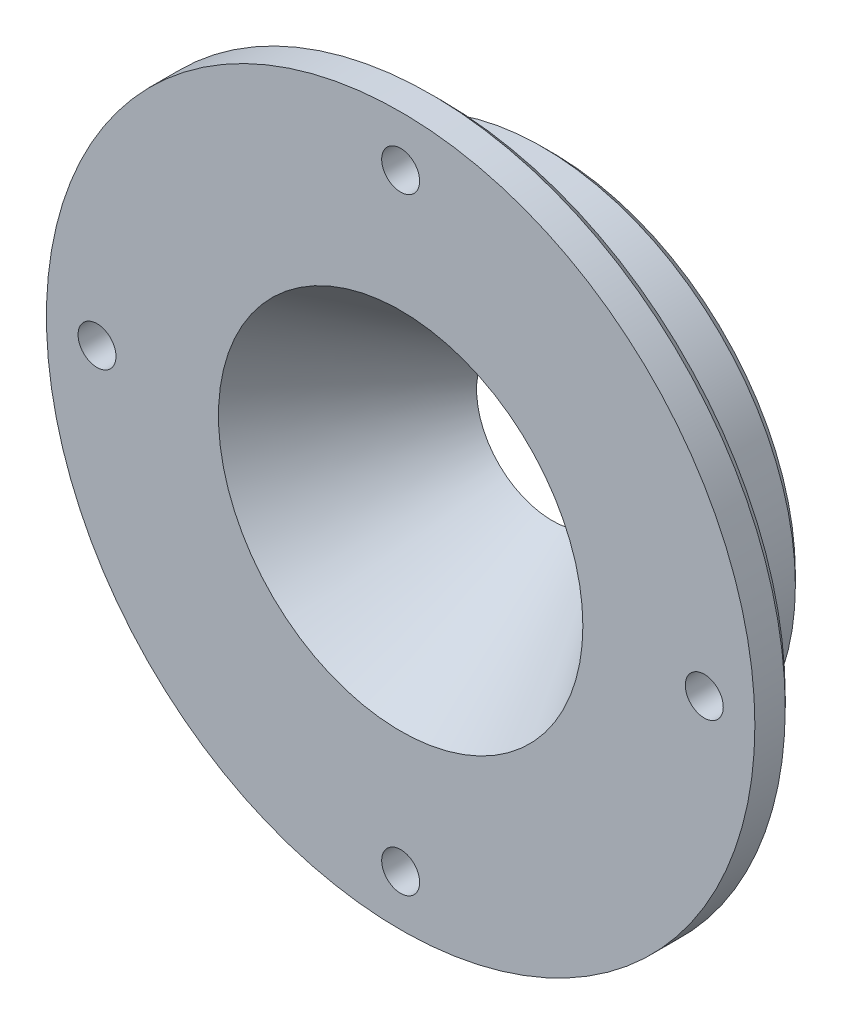
ISO-10303-21;
HEADER;
FILE_DESCRIPTION(('STEP AP214'),'2;1');
FILE_NAME('part.step','',(''),(''),'','','');
FILE_SCHEMA(('AUTOMOTIVE_DESIGN { 1 0 10303 214 1 1 1 1 }'));
ENDSEC;
DATA;
#1=APPLICATION_CONTEXT('core data for automotive mechanical design processes');
#2=APPLICATION_PROTOCOL_DEFINITION('international standard','automotive_design',2000,#1);
#3=PRODUCT_CONTEXT('',#1,'mechanical');
#4=PRODUCT('Part','Part','',(#3));
#5=PRODUCT_RELATED_PRODUCT_CATEGORY('part','',(#4));
#6=PRODUCT_DEFINITION_FORMATION('','',#4);
#7=PRODUCT_DEFINITION_CONTEXT('part definition',#1,'design');
#8=PRODUCT_DEFINITION('design','',#6,#7);
#9=PRODUCT_DEFINITION_SHAPE('','',#8);
#10=(LENGTH_UNIT() NAMED_UNIT(*) SI_UNIT(.MILLI.,.METRE.));
#11=(NAMED_UNIT(*) PLANE_ANGLE_UNIT() SI_UNIT($,.RADIAN.));
#12=(NAMED_UNIT(*) SI_UNIT($,.STERADIAN.) SOLID_ANGLE_UNIT());
#13=UNCERTAINTY_MEASURE_WITH_UNIT(LENGTH_MEASURE(1.E-05),#10,'distance_accuracy_value','');
#14=(GEOMETRIC_REPRESENTATION_CONTEXT(3) GLOBAL_UNCERTAINTY_ASSIGNED_CONTEXT((#13)) GLOBAL_UNIT_ASSIGNED_CONTEXT((#10,
#11,#12)) REPRESENTATION_CONTEXT('',''));
#15=CARTESIAN_POINT('',(0.,0.,0.));
#16=DIRECTION('',(0.,0.,1.));
#17=DIRECTION('',(1.,0.,0.));
#18=AXIS2_PLACEMENT_3D('',#15,#16,#17);
#19=CARTESIAN_POINT('',(0.,44.45,0.));
#20=DIRECTION('',(0.,0.,-1.));
#21=DIRECTION('',(-1.,0.,0.));
#22=AXIS2_PLACEMENT_3D('',#19,#20,#21);
#23=PLANE('',#22);
#24=CARTESIAN_POINT('',(0.,38.1,0.));
#25=DIRECTION('',(0.,0.,1.));
#26=DIRECTION('',(1.,0.,0.));
#27=AXIS2_PLACEMENT_3D('',#24,#25,#26);
#28=CIRCLE('',#27,2.38124999999999);
#29=CARTESIAN_POINT('',(2.38124999999999,38.1,0.));
#30=VERTEX_POINT('',#29);
#31=EDGE_CURVE('E93',#30,#30,#28,.T.);
#32=ORIENTED_EDGE('',*,*,#31,.F.);
#33=EDGE_LOOP('',(#32));
#34=FACE_BOUND('',#33,.T.);
#35=CARTESIAN_POINT('',(38.1000000000011,1.07820122499364E-12,0.));
#36=DIRECTION('',(0.,0.,1.));
#37=DIRECTION('',(1.,0.,0.));
#38=AXIS2_PLACEMENT_3D('',#35,#36,#37);
#39=CIRCLE('',#38,2.38124999999999);
#40=CARTESIAN_POINT('',(40.4812500000011,1.07820122499364E-12,0.));
#41=VERTEX_POINT('',#40);
#42=EDGE_CURVE('E87',#41,#41,#39,.T.);
#43=ORIENTED_EDGE('',*,*,#42,.F.);
#44=EDGE_LOOP('',(#43));
#45=FACE_BOUND('',#44,.T.);
#46=CARTESIAN_POINT('',(2.15640244998728E-12,-38.1,0.));
#47=DIRECTION('',(0.,0.,1.));
#48=DIRECTION('',(1.,0.,0.));
#49=AXIS2_PLACEMENT_3D('',#46,#47,#48);
#50=CIRCLE('',#49,2.38124999999999);
#51=CARTESIAN_POINT('',(2.38125000000214,-38.1,0.));
#52=VERTEX_POINT('',#51);
#53=EDGE_CURVE('E81',#52,#52,#50,.T.);
#54=ORIENTED_EDGE('',*,*,#53,.F.);
#55=EDGE_LOOP('',(#54));
#56=FACE_BOUND('',#55,.T.);
#57=CARTESIAN_POINT('',(-38.0999999999989,-1.07353532068889E-12,0.));
#58=DIRECTION('',(0.,0.,1.));
#59=DIRECTION('',(1.,0.,0.));
#60=AXIS2_PLACEMENT_3D('',#57,#58,#59);
#61=CIRCLE('',#60,2.38124999999999);
#62=CARTESIAN_POINT('',(-35.7187499999989,-1.07353532068889E-12,0.));
#63=VERTEX_POINT('',#62);
#64=EDGE_CURVE('E75',#63,#63,#61,.T.);
#65=ORIENTED_EDGE('',*,*,#64,.F.);
#66=EDGE_LOOP('',(#65));
#67=FACE_BOUND('',#66,.T.);
#68=CARTESIAN_POINT('',(0.,0.,0.));
#69=DIRECTION('',(0.,0.,1.));
#70=DIRECTION('',(1.,0.,0.));
#71=AXIS2_PLACEMENT_3D('',#68,#69,#70);
#72=CIRCLE('',#71,22.863953602895);
#73=CARTESIAN_POINT('',(22.863953602895,0.,0.));
#74=VERTEX_POINT('',#73);
#75=EDGE_CURVE('E69',#74,#74,#72,.T.);
#76=ORIENTED_EDGE('',*,*,#75,.F.);
#77=EDGE_LOOP('',(#76));
#78=FACE_BOUND('',#77,.T.);
#79=CARTESIAN_POINT('',(0.,0.,0.));
#80=DIRECTION('',(0.,0.,1.));
#81=DIRECTION('',(1.,0.,0.));
#82=AXIS2_PLACEMENT_3D('',#79,#80,#81);
#83=CIRCLE('',#82,44.45);
#84=CARTESIAN_POINT('',(44.45,0.,0.));
#85=VERTEX_POINT('',#84);
#86=EDGE_CURVE('E63',#85,#85,#83,.T.);
#87=ORIENTED_EDGE('',*,*,#86,.T.);
#88=EDGE_LOOP('',(#87));
#89=FACE_BOUND('',#88,.T.);
#90=ADVANCED_FACE('F37',(#34,#45,#56,#67,#78,#89),#23,.F.);
#91=CARTESIAN_POINT('',(0.,0.,18.4541508810496));
#92=DIRECTION('',(0.,0.,1.));
#93=DIRECTION('',(1.,0.,0.));
#94=AXIS2_PLACEMENT_3D('',#91,#92,#93);
#95=CYLINDRICAL_SURFACE('',#94,44.45);
#96=CARTESIAN_POINT('',(0.,0.,-3.81000000000002));
#97=DIRECTION('',(0.,0.,1.));
#98=DIRECTION('',(1.,0.,0.));
#99=AXIS2_PLACEMENT_3D('',#96,#97,#98);
#100=CIRCLE('',#99,44.45);
#101=CARTESIAN_POINT('',(44.45,0.,-3.81000000000002));
#102=VERTEX_POINT('',#101);
#103=EDGE_CURVE('E52',#102,#102,#100,.T.);
#104=ORIENTED_EDGE('',*,*,#103,.T.);
#105=EDGE_LOOP('',(#104));
#106=FACE_BOUND('',#105,.T.);
#107=ORIENTED_EDGE('',*,*,#86,.F.);
#108=EDGE_LOOP('',(#107));
#109=FACE_BOUND('',#108,.T.);
#110=ADVANCED_FACE('F102',(#106,#109),#95,.T.);
#111=CARTESIAN_POINT('',(0.,31.75,-5.08));
#112=DIRECTION('',(0.,0.,1.));
#113=DIRECTION('',(1.,0.,0.));
#114=AXIS2_PLACEMENT_3D('',#111,#112,#113);
#115=PLANE('',#114);
#116=CARTESIAN_POINT('',(0.,0.,-5.08));
#117=DIRECTION('',(0.,0.,1.));
#118=DIRECTION('',(1.,0.,0.));
#119=AXIS2_PLACEMENT_3D('',#116,#117,#118);
#120=CIRCLE('',#119,43.18);
#121=CARTESIAN_POINT('',(43.18,0.,-5.08));
#122=VERTEX_POINT('',#121);
#123=EDGE_CURVE('E48',#122,#122,#120,.F.);
#124=ORIENTED_EDGE('',*,*,#123,.T.);
#125=EDGE_LOOP('',(#124));
#126=FACE_BOUND('',#125,.T.);
#127=CARTESIAN_POINT('',(0.,0.,-5.08));
#128=DIRECTION('',(0.,0.,1.));
#129=DIRECTION('',(1.,0.,0.));
#130=AXIS2_PLACEMENT_3D('',#127,#128,#129);
#131=CIRCLE('',#130,34.29);
#132=CARTESIAN_POINT('',(34.29,0.,-5.08));
#133=VERTEX_POINT('',#132);
#134=EDGE_CURVE('E60',#133,#133,#131,.T.);
#135=ORIENTED_EDGE('',*,*,#134,.T.);
#136=EDGE_LOOP('',(#135));
#137=FACE_BOUND('',#136,.T.);
#138=CARTESIAN_POINT('',(0.,38.1,-5.08));
#139=DIRECTION('',(0.,0.,1.));
#140=DIRECTION('',(1.,0.,0.));
#141=AXIS2_PLACEMENT_3D('',#138,#139,#140);
#142=CIRCLE('',#141,2.38124999999999);
#143=CARTESIAN_POINT('',(2.38124999999999,38.1,-5.08));
#144=VERTEX_POINT('',#143);
#145=EDGE_CURVE('E90',#144,#144,#142,.T.);
#146=ORIENTED_EDGE('',*,*,#145,.T.);
#147=EDGE_LOOP('',(#146));
#148=FACE_BOUND('',#147,.T.);
#149=CARTESIAN_POINT('',(38.1000000000011,1.07820122499364E-12,-5.08));
#150=DIRECTION('',(0.,0.,1.));
#151=DIRECTION('',(1.,0.,0.));
#152=AXIS2_PLACEMENT_3D('',#149,#150,#151);
#153=CIRCLE('',#152,2.38124999999999);
#154=CARTESIAN_POINT('',(40.4812500000011,1.07820122499364E-12,-5.08));
#155=VERTEX_POINT('',#154);
#156=EDGE_CURVE('E84',#155,#155,#153,.T.);
#157=ORIENTED_EDGE('',*,*,#156,.T.);
#158=EDGE_LOOP('',(#157));
#159=FACE_BOUND('',#158,.T.);
#160=CARTESIAN_POINT('',(2.15640244998728E-12,-38.1,-5.08));
#161=DIRECTION('',(0.,0.,1.));
#162=DIRECTION('',(1.,0.,0.));
#163=AXIS2_PLACEMENT_3D('',#160,#161,#162);
#164=CIRCLE('',#163,2.38124999999999);
#165=CARTESIAN_POINT('',(2.38125000000215,-38.1,-5.08));
#166=VERTEX_POINT('',#165);
#167=EDGE_CURVE('E78',#166,#166,#164,.T.);
#168=ORIENTED_EDGE('',*,*,#167,.T.);
#169=EDGE_LOOP('',(#168));
#170=FACE_BOUND('',#169,.T.);
#171=CARTESIAN_POINT('',(-38.0999999999989,-1.07353532068889E-12,-5.08));
#172=DIRECTION('',(0.,0.,1.));
#173=DIRECTION('',(1.,0.,0.));
#174=AXIS2_PLACEMENT_3D('',#171,#172,#173);
#175=CIRCLE('',#174,2.38124999999999);
#176=CARTESIAN_POINT('',(-35.7187499999989,-1.07353532068889E-12,-5.08));
#177=VERTEX_POINT('',#176);
#178=EDGE_CURVE('E72',#177,#177,#175,.T.);
#179=ORIENTED_EDGE('',*,*,#178,.T.);
#180=EDGE_LOOP('',(#179));
#181=FACE_BOUND('',#180,.T.);
#182=ADVANCED_FACE('F115',(#126,#137,#148,#159,#170,#181),#115,.F.);
#183=CARTESIAN_POINT('',(0.,0.,18.4541508810496));
#184=DIRECTION('',(0.,0.,1.));
#185=DIRECTION('',(1.,0.,0.));
#186=AXIS2_PLACEMENT_3D('',#183,#184,#185);
#187=CYLINDRICAL_SURFACE('',#186,31.75);
#188=CARTESIAN_POINT('',(0.,0.,-17.78));
#189=DIRECTION('',(0.,0.,1.));
#190=DIRECTION('',(1.,0.,0.));
#191=AXIS2_PLACEMENT_3D('',#188,#189,#190);
#192=CIRCLE('',#191,31.75);
#193=CARTESIAN_POINT('',(31.75,0.,-17.78));
#194=VERTEX_POINT('',#193);
#195=EDGE_CURVE('E44',#194,#194,#192,.T.);
#196=ORIENTED_EDGE('',*,*,#195,.T.);
#197=EDGE_LOOP('',(#196));
#198=FACE_BOUND('',#197,.T.);
#199=CARTESIAN_POINT('',(0.,0.,-7.62));
#200=DIRECTION('',(0.,0.,1.));
#201=DIRECTION('',(1.,0.,0.));
#202=AXIS2_PLACEMENT_3D('',#199,#200,#201);
#203=CIRCLE('',#202,31.75);
#204=CARTESIAN_POINT('',(31.75,0.,-7.62));
#205=VERTEX_POINT('',#204);
#206=EDGE_CURVE('E57',#205,#205,#203,.F.);
#207=ORIENTED_EDGE('',*,*,#206,.T.);
#208=EDGE_LOOP('',(#207));
#209=FACE_BOUND('',#208,.T.);
#210=ADVANCED_FACE('F121',(#198,#209),#187,.T.);
#211=CARTESIAN_POINT('',(0.,9.525,-19.05));
#212=DIRECTION('',(0.,0.,1.));
#213=DIRECTION('',(1.,0.,0.));
#214=AXIS2_PLACEMENT_3D('',#211,#212,#213);
#215=PLANE('',#214);
#216=CARTESIAN_POINT('',(0.,0.,-19.05));
#217=DIRECTION('',(0.,0.,1.));
#218=DIRECTION('',(1.,0.,0.));
#219=AXIS2_PLACEMENT_3D('',#216,#217,#218);
#220=CIRCLE('',#219,30.48);
#221=CARTESIAN_POINT('',(30.48,0.,-19.05));
#222=VERTEX_POINT('',#221);
#223=EDGE_CURVE('E10',#222,#222,#220,.F.);
#224=ORIENTED_EDGE('',*,*,#223,.T.);
#225=EDGE_LOOP('',(#224));
#226=FACE_BOUND('',#225,.T.);
#227=CARTESIAN_POINT('',(0.,0.,-19.05));
#228=DIRECTION('',(0.,0.,1.));
#229=DIRECTION('',(1.,0.,0.));
#230=AXIS2_PLACEMENT_3D('',#227,#228,#229);
#231=CIRCLE('',#230,9.525);
#232=CARTESIAN_POINT('',(9.525,0.,-19.05));
#233=VERTEX_POINT('',#232);
#234=EDGE_CURVE('E66',#233,#233,#231,.T.);
#235=ORIENTED_EDGE('',*,*,#234,.T.);
#236=EDGE_LOOP('',(#235));
#237=FACE_BOUND('',#236,.T.);
#238=ADVANCED_FACE('F163',(#226,#237),#215,.F.);
#239=CARTESIAN_POINT('',(0.,0.,0.));
#240=DIRECTION('',(0.,0.,1.));
#241=DIRECTION('',(1.,0.,0.));
#242=AXIS2_PLACEMENT_3D('',#239,#240,#241);
#243=CONICAL_SURFACE('',#242,22.863953602895,0.610865238198017);
#244=ORIENTED_EDGE('',*,*,#234,.F.);
#245=EDGE_LOOP('',(#244));
#246=FACE_BOUND('',#245,.T.);
#247=ORIENTED_EDGE('',*,*,#75,.T.);
#248=EDGE_LOOP('',(#247));
#249=FACE_BOUND('',#248,.T.);
#250=ADVANCED_FACE('F153',(#246,#249),#243,.F.);
#251=CARTESIAN_POINT('',(-38.0999999999989,-1.07353532068889E-12,0.));
#252=DIRECTION('',(0.,0.,1.));
#253=DIRECTION('',(1.,0.,0.));
#254=AXIS2_PLACEMENT_3D('',#251,#252,#253);
#255=CYLINDRICAL_SURFACE('',#254,2.38124999999999);
#256=ORIENTED_EDGE('',*,*,#64,.T.);
#257=EDGE_LOOP('',(#256));
#258=FACE_BOUND('',#257,.T.);
#259=ORIENTED_EDGE('',*,*,#178,.F.);
#260=EDGE_LOOP('',(#259));
#261=FACE_BOUND('',#260,.T.);
#262=ADVANCED_FACE('F150',(#258,#261),#255,.F.);
#263=CARTESIAN_POINT('',(2.15640244998728E-12,-38.1,0.));
#264=DIRECTION('',(0.,0.,1.));
#265=DIRECTION('',(1.,0.,0.));
#266=AXIS2_PLACEMENT_3D('',#263,#264,#265);
#267=CYLINDRICAL_SURFACE('',#266,2.38124999999999);
#268=ORIENTED_EDGE('',*,*,#53,.T.);
#269=EDGE_LOOP('',(#268));
#270=FACE_BOUND('',#269,.T.);
#271=ORIENTED_EDGE('',*,*,#167,.F.);
#272=EDGE_LOOP('',(#271));
#273=FACE_BOUND('',#272,.T.);
#274=ADVANCED_FACE('F152',(#270,#273),#267,.F.);
#275=CARTESIAN_POINT('',(38.1000000000011,1.07820122499364E-12,0.));
#276=DIRECTION('',(0.,0.,1.));
#277=DIRECTION('',(1.,0.,0.));
#278=AXIS2_PLACEMENT_3D('',#275,#276,#277);
#279=CYLINDRICAL_SURFACE('',#278,2.38124999999999);
#280=ORIENTED_EDGE('',*,*,#42,.T.);
#281=EDGE_LOOP('',(#280));
#282=FACE_BOUND('',#281,.T.);
#283=ORIENTED_EDGE('',*,*,#156,.F.);
#284=EDGE_LOOP('',(#283));
#285=FACE_BOUND('',#284,.T.);
#286=ADVANCED_FACE('F160',(#282,#285),#279,.F.);
#287=CARTESIAN_POINT('',(0.,38.1,0.));
#288=DIRECTION('',(0.,0.,1.));
#289=DIRECTION('',(1.,0.,0.));
#290=AXIS2_PLACEMENT_3D('',#287,#288,#289);
#291=CYLINDRICAL_SURFACE('',#290,2.38124999999999);
#292=ORIENTED_EDGE('',*,*,#31,.T.);
#293=EDGE_LOOP('',(#292));
#294=FACE_BOUND('',#293,.T.);
#295=ORIENTED_EDGE('',*,*,#145,.F.);
#296=EDGE_LOOP('',(#295));
#297=FACE_BOUND('',#296,.T.);
#298=ADVANCED_FACE('F97',(#294,#297),#291,.F.);
#299=CARTESIAN_POINT('',(0.,0.,-7.62));
#300=DIRECTION('',(0.,0.,1.));
#301=DIRECTION('',(1.,0.,0.));
#302=AXIS2_PLACEMENT_3D('',#299,#300,#301);
#303=TOROIDAL_SURFACE('',#302,34.29,2.54);
#304=ORIENTED_EDGE('',*,*,#206,.F.);
#305=EDGE_LOOP('',(#304));
#306=FACE_BOUND('',#305,.T.);
#307=ORIENTED_EDGE('',*,*,#134,.F.);
#308=EDGE_LOOP('',(#307));
#309=FACE_BOUND('',#308,.T.);
#310=ADVANCED_FACE('F126',(#306,#309),#303,.F.);
#311=CARTESIAN_POINT('',(0.,0.,-3.81000000000002));
#312=DIRECTION('',(0.,0.,1.));
#313=DIRECTION('',(1.,0.,0.));
#314=AXIS2_PLACEMENT_3D('',#311,#312,#313);
#315=CONICAL_SURFACE('',#314,44.45,0.785398163397451);
#316=ORIENTED_EDGE('',*,*,#123,.F.);
#317=EDGE_LOOP('',(#316));
#318=FACE_BOUND('',#317,.T.);
#319=ORIENTED_EDGE('',*,*,#103,.F.);
#320=EDGE_LOOP('',(#319));
#321=FACE_BOUND('',#320,.T.);
#322=ADVANCED_FACE('F128',(#318,#321),#315,.T.);
#323=CARTESIAN_POINT('',(0.,0.,-17.78));
#324=DIRECTION('',(0.,0.,1.));
#325=DIRECTION('',(1.,0.,0.));
#326=AXIS2_PLACEMENT_3D('',#323,#324,#325);
#327=CONICAL_SURFACE('',#326,31.75,0.785398163397454);
#328=ORIENTED_EDGE('',*,*,#223,.F.);
#329=EDGE_LOOP('',(#328));
#330=FACE_BOUND('',#329,.T.);
#331=ORIENTED_EDGE('',*,*,#195,.F.);
#332=EDGE_LOOP('',(#331));
#333=FACE_BOUND('',#332,.T.);
#334=ADVANCED_FACE('F39',(#330,#333),#327,.T.);
#335=CLOSED_SHELL('',(#90,#110,#182,#210,#238,#250,#262,#274,#286,#298,#310,#322,#334));
#336=MANIFOLD_SOLID_BREP('B2',#335);
#337=ADVANCED_BREP_SHAPE_REPRESENTATION('',(#18,#336),#14);
#338=SHAPE_DEFINITION_REPRESENTATION(#9,#337);
ENDSEC;
END-ISO-10303-21;
